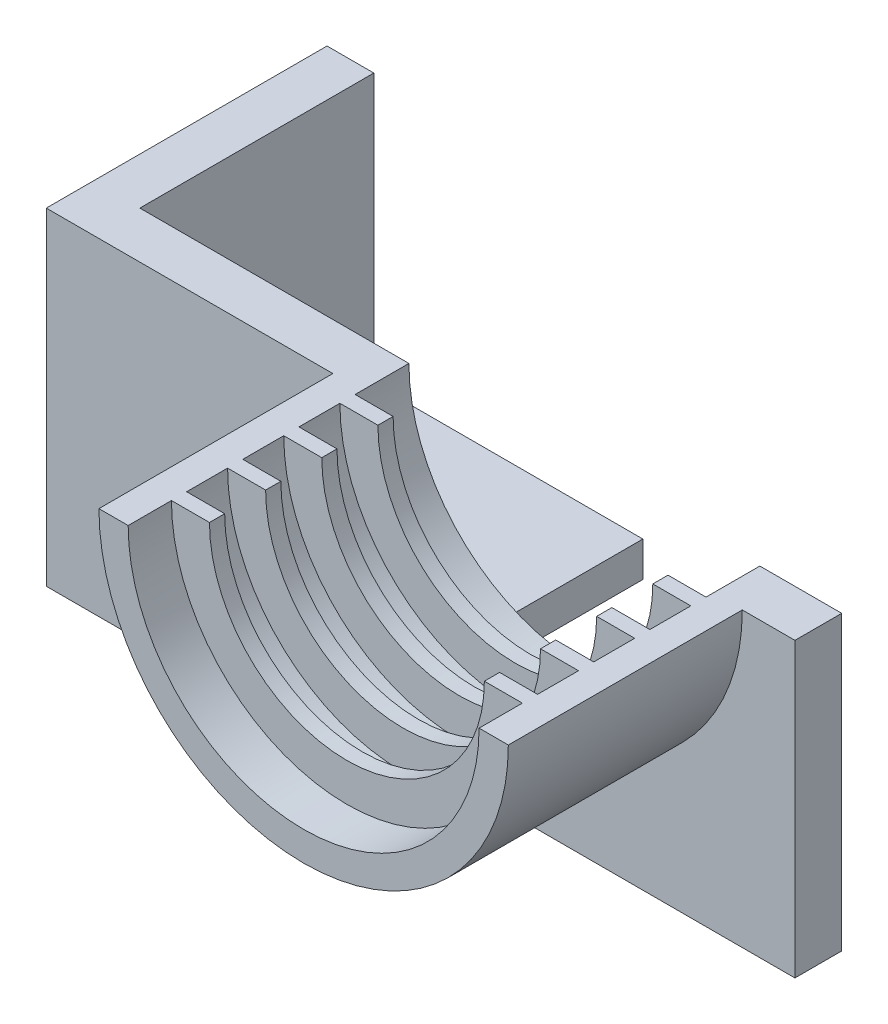
ISO-10303-21;
HEADER;
FILE_DESCRIPTION(('STEP AP214'),'2;1');
FILE_NAME('part.step','',(''),(''),'','','');
FILE_SCHEMA(('AUTOMOTIVE_DESIGN { 1 0 10303 214 1 1 1 1 }'));
ENDSEC;
DATA;
#1=APPLICATION_CONTEXT('core data for automotive mechanical design processes');
#2=APPLICATION_PROTOCOL_DEFINITION('international standard','automotive_design',2000,#1);
#3=PRODUCT_CONTEXT('',#1,'mechanical');
#4=PRODUCT('Part','Part','',(#3));
#5=PRODUCT_RELATED_PRODUCT_CATEGORY('part','',(#4));
#6=PRODUCT_DEFINITION_FORMATION('','',#4);
#7=PRODUCT_DEFINITION_CONTEXT('part definition',#1,'design');
#8=PRODUCT_DEFINITION('design','',#6,#7);
#9=PRODUCT_DEFINITION_SHAPE('','',#8);
#10=(LENGTH_UNIT() NAMED_UNIT(*) SI_UNIT(.MILLI.,.METRE.));
#11=(NAMED_UNIT(*) PLANE_ANGLE_UNIT() SI_UNIT($,.RADIAN.));
#12=(NAMED_UNIT(*) SI_UNIT($,.STERADIAN.) SOLID_ANGLE_UNIT());
#13=UNCERTAINTY_MEASURE_WITH_UNIT(LENGTH_MEASURE(1.E-05),#10,'distance_accuracy_value','');
#14=(GEOMETRIC_REPRESENTATION_CONTEXT(3) GLOBAL_UNCERTAINTY_ASSIGNED_CONTEXT((#13)) GLOBAL_UNIT_ASSIGNED_CONTEXT((#10,
#11,#12)) REPRESENTATION_CONTEXT('',''));
#15=CARTESIAN_POINT('',(0.,0.,0.));
#16=DIRECTION('',(0.,0.,1.));
#17=DIRECTION('',(1.,0.,0.));
#18=AXIS2_PLACEMENT_3D('',#15,#16,#17);
#19=CARTESIAN_POINT('',(66.,8.,-6.));
#20=DIRECTION('',(0.,1.,0.));
#21=DIRECTION('',(-1.,0.,0.));
#22=AXIS2_PLACEMENT_3D('',#19,#20,#21);
#23=PLANE('',#22);
#24=DIRECTION('',(1.,0.,0.));
#25=VECTOR('',#24,1.);
#26=CARTESIAN_POINT('',(0.,7.99999999999999,0.));
#27=LINE('',#26,#25);
#28=CARTESIAN_POINT('',(16.,7.99999999999999,0.));
#29=VERTEX_POINT('',#28);
#30=CARTESIAN_POINT('',(55.,8.,0.));
#31=VERTEX_POINT('',#30);
#32=EDGE_CURVE('E244',#29,#31,#27,.T.);
#33=ORIENTED_EDGE('',*,*,#32,.T.);
#34=DIRECTION('',(0.,0.,1.));
#35=VECTOR('',#34,1.);
#36=CARTESIAN_POINT('',(55.,8.,-22.));
#37=LINE('',#36,#35);
#38=CARTESIAN_POINT('',(55.,8.,4.));
#39=VERTEX_POINT('',#38);
#40=EDGE_CURVE('E46',#31,#39,#37,.T.);
#41=ORIENTED_EDGE('',*,*,#40,.T.);
#42=DIRECTION('',(-1.,0.,0.));
#43=VECTOR('',#42,1.);
#44=CARTESIAN_POINT('',(66.,8.,4.));
#45=LINE('',#44,#43);
#46=CARTESIAN_POINT('',(16.,7.99999999999999,4.));
#47=VERTEX_POINT('',#46);
#48=EDGE_CURVE('E237',#39,#47,#45,.T.);
#49=ORIENTED_EDGE('',*,*,#48,.T.);
#50=DIRECTION('',(0.,0.,1.));
#51=VECTOR('',#50,1.);
#52=CARTESIAN_POINT('',(16.,7.99999999999999,-22.));
#53=LINE('',#52,#51);
#54=EDGE_CURVE('E40',#29,#47,#53,.T.);
#55=ORIENTED_EDGE('',*,*,#54,.F.);
#56=EDGE_LOOP('',(#33,#41,#49,#55));
#57=FACE_BOUND('',#56,.T.);
#58=ADVANCED_FACE('F32',(#57),#23,.F.);
#59=CARTESIAN_POINT('',(0.,33.,4.));
#60=DIRECTION('',(0.,-1.,0.));
#61=DIRECTION('',(0.,0.,-1.));
#62=AXIS2_PLACEMENT_3D('',#59,#60,#61);
#63=PLANE('',#62);
#64=DIRECTION('',(-1.,0.,0.));
#65=VECTOR('',#64,1.);
#66=CARTESIAN_POINT('',(0.,33.,4.));
#67=LINE('',#66,#65);
#68=CARTESIAN_POINT('',(55.,33.,4.));
#69=VERTEX_POINT('',#68);
#70=CARTESIAN_POINT('',(50.5,33.,4.));
#71=VERTEX_POINT('',#70);
#72=EDGE_CURVE('E234',#69,#71,#67,.T.);
#73=ORIENTED_EDGE('',*,*,#72,.F.);
#74=DIRECTION('',(0.,0.,1.));
#75=VECTOR('',#74,1.);
#76=CARTESIAN_POINT('',(55.,33.,-22.));
#77=LINE('',#76,#75);
#78=CARTESIAN_POINT('',(55.,33.,0.));
#79=VERTEX_POINT('',#78);
#80=EDGE_CURVE('E223',#79,#69,#77,.T.);
#81=ORIENTED_EDGE('',*,*,#80,.F.);
#82=DIRECTION('',(-1.,0.,0.));
#83=VECTOR('',#82,1.);
#84=CARTESIAN_POINT('',(0.,33.,0.));
#85=LINE('',#84,#83);
#86=CARTESIAN_POINT('',(48.,33.,0.));
#87=VERTEX_POINT('',#86);
#88=EDGE_CURVE('E249',#79,#87,#85,.T.);
#89=ORIENTED_EDGE('',*,*,#88,.T.);
#90=DIRECTION('',(0.,0.,1.));
#91=VECTOR('',#90,1.);
#92=CARTESIAN_POINT('',(48.,33.,0.));
#93=LINE('',#92,#91);
#94=CARTESIAN_POINT('',(48.,33.,4.6));
#95=VERTEX_POINT('',#94);
#96=EDGE_CURVE('E252',#87,#95,#93,.T.);
#97=ORIENTED_EDGE('',*,*,#96,.T.);
#98=DIRECTION('',(-1.,0.,0.));
#99=VECTOR('',#98,1.);
#100=CARTESIAN_POINT('',(44.75,33.,4.6));
#101=LINE('',#100,#99);
#102=CARTESIAN_POINT('',(44.75,33.,4.6));
#103=VERTEX_POINT('',#102);
#104=EDGE_CURVE('E384',#95,#103,#101,.T.);
#105=ORIENTED_EDGE('',*,*,#104,.T.);
#106=DIRECTION('',(0.,0.,-1.));
#107=VECTOR('',#106,1.);
#108=CARTESIAN_POINT('',(44.75,33.,5.9));
#109=LINE('',#108,#107);
#110=CARTESIAN_POINT('',(44.75,33.,5.9));
#111=VERTEX_POINT('',#110);
#112=EDGE_CURVE('E392',#111,#103,#109,.T.);
#113=ORIENTED_EDGE('',*,*,#112,.F.);
#114=DIRECTION('',(-1.,0.,0.));
#115=VECTOR('',#114,1.);
#116=CARTESIAN_POINT('',(44.75,33.,5.9));
#117=LINE('',#116,#115);
#118=CARTESIAN_POINT('',(48.,33.,5.9));
#119=VERTEX_POINT('',#118);
#120=EDGE_CURVE('E374',#119,#111,#117,.T.);
#121=ORIENTED_EDGE('',*,*,#120,.F.);
#122=CARTESIAN_POINT('',(48.,33.,9.4));
#123=VERTEX_POINT('',#122);
#124=EDGE_CURVE('E427',#119,#123,#93,.T.);
#125=ORIENTED_EDGE('',*,*,#124,.T.);
#126=DIRECTION('',(-1.,0.,0.));
#127=VECTOR('',#126,1.);
#128=CARTESIAN_POINT('',(44.75,33.,9.4));
#129=LINE('',#128,#127);
#130=CARTESIAN_POINT('',(44.75,33.,9.4));
#131=VERTEX_POINT('',#130);
#132=EDGE_CURVE('E359',#123,#131,#129,.T.);
#133=ORIENTED_EDGE('',*,*,#132,.T.);
#134=DIRECTION('',(0.,0.,-1.));
#135=VECTOR('',#134,1.);
#136=CARTESIAN_POINT('',(44.75,33.,10.7));
#137=LINE('',#136,#135);
#138=CARTESIAN_POINT('',(44.75,33.,10.7));
#139=VERTEX_POINT('',#138);
#140=EDGE_CURVE('E367',#139,#131,#137,.T.);
#141=ORIENTED_EDGE('',*,*,#140,.F.);
#142=DIRECTION('',(-1.,0.,0.));
#143=VECTOR('',#142,1.);
#144=CARTESIAN_POINT('',(44.75,33.,10.7));
#145=LINE('',#144,#143);
#146=CARTESIAN_POINT('',(48.,33.,10.7));
#147=VERTEX_POINT('',#146);
#148=EDGE_CURVE('E349',#147,#139,#145,.T.);
#149=ORIENTED_EDGE('',*,*,#148,.F.);
#150=CARTESIAN_POINT('',(48.,33.,14.2));
#151=VERTEX_POINT('',#150);
#152=EDGE_CURVE('E431',#147,#151,#93,.T.);
#153=ORIENTED_EDGE('',*,*,#152,.T.);
#154=DIRECTION('',(-1.,0.,0.));
#155=VECTOR('',#154,1.);
#156=CARTESIAN_POINT('',(44.75,33.,14.2));
#157=LINE('',#156,#155);
#158=CARTESIAN_POINT('',(44.75,33.,14.2));
#159=VERTEX_POINT('',#158);
#160=EDGE_CURVE('E334',#151,#159,#157,.T.);
#161=ORIENTED_EDGE('',*,*,#160,.T.);
#162=DIRECTION('',(0.,0.,-1.));
#163=VECTOR('',#162,1.);
#164=CARTESIAN_POINT('',(44.75,33.,15.5));
#165=LINE('',#164,#163);
#166=CARTESIAN_POINT('',(44.75,33.,15.5));
#167=VERTEX_POINT('',#166);
#168=EDGE_CURVE('E342',#167,#159,#165,.T.);
#169=ORIENTED_EDGE('',*,*,#168,.F.);
#170=DIRECTION('',(-1.,0.,0.));
#171=VECTOR('',#170,1.);
#172=CARTESIAN_POINT('',(44.75,33.,15.5));
#173=LINE('',#172,#171);
#174=CARTESIAN_POINT('',(48.,33.,15.5));
#175=VERTEX_POINT('',#174);
#176=EDGE_CURVE('E324',#175,#167,#173,.T.);
#177=ORIENTED_EDGE('',*,*,#176,.F.);
#178=CARTESIAN_POINT('',(48.,33.,19.));
#179=VERTEX_POINT('',#178);
#180=EDGE_CURVE('E432',#175,#179,#93,.T.);
#181=ORIENTED_EDGE('',*,*,#180,.T.);
#182=DIRECTION('',(-1.,0.,0.));
#183=VECTOR('',#182,1.);
#184=CARTESIAN_POINT('',(44.75,33.,19.));
#185=LINE('',#184,#183);
#186=CARTESIAN_POINT('',(44.75,33.,19.));
#187=VERTEX_POINT('',#186);
#188=EDGE_CURVE('E309',#179,#187,#185,.T.);
#189=ORIENTED_EDGE('',*,*,#188,.T.);
#190=DIRECTION('',(0.,0.,-1.));
#191=VECTOR('',#190,1.);
#192=CARTESIAN_POINT('',(44.75,33.,20.3));
#193=LINE('',#192,#191);
#194=CARTESIAN_POINT('',(44.75,33.,20.3));
#195=VERTEX_POINT('',#194);
#196=EDGE_CURVE('E317',#195,#187,#193,.T.);
#197=ORIENTED_EDGE('',*,*,#196,.F.);
#198=DIRECTION('',(-1.,0.,0.));
#199=VECTOR('',#198,1.);
#200=CARTESIAN_POINT('',(44.75,33.,20.3));
#201=LINE('',#200,#199);
#202=CARTESIAN_POINT('',(48.,33.,20.3));
#203=VERTEX_POINT('',#202);
#204=EDGE_CURVE('E299',#203,#195,#201,.T.);
#205=ORIENTED_EDGE('',*,*,#204,.F.);
#206=CARTESIAN_POINT('',(48.,33.,24.));
#207=VERTEX_POINT('',#206);
#208=EDGE_CURVE('E413',#203,#207,#93,.T.);
#209=ORIENTED_EDGE('',*,*,#208,.T.);
#210=DIRECTION('',(-1.,0.,0.));
#211=VECTOR('',#210,1.);
#212=CARTESIAN_POINT('',(48.,33.,24.));
#213=LINE('',#212,#211);
#214=CARTESIAN_POINT('',(50.5,33.,24.));
#215=VERTEX_POINT('',#214);
#216=EDGE_CURVE('E403',#215,#207,#213,.T.);
#217=ORIENTED_EDGE('',*,*,#216,.F.);
#218=DIRECTION('',(0.,0.,-1.));
#219=VECTOR('',#218,1.);
#220=CARTESIAN_POINT('',(50.5,33.,24.));
#221=LINE('',#220,#219);
#222=EDGE_CURVE('E243',#215,#71,#221,.T.);
#223=ORIENTED_EDGE('',*,*,#222,.T.);
#224=EDGE_LOOP('',(#73,#81,#89,#97,#105,#113,#121,#125,#133,#141,#149,#153,#161,#169,#177,#181,
#189,#197,#205,#209,#217,#223));
#225=FACE_BOUND('',#224,.T.);
#226=ADVANCED_FACE('F240',(#225),#63,.F.);
#227=CARTESIAN_POINT('',(0.,0.,4.));
#228=DIRECTION('',(0.,0.,-1.));
#229=DIRECTION('',(-1.,0.,0.));
#230=AXIS2_PLACEMENT_3D('',#227,#228,#229);
#231=PLANE('',#230);
#232=ORIENTED_EDGE('',*,*,#48,.F.);
#233=DIRECTION('',(0.,-1.,0.));
#234=VECTOR('',#233,1.);
#235=CARTESIAN_POINT('',(55.,8.,4.));
#236=LINE('',#235,#234);
#237=EDGE_CURVE('E226',#69,#39,#236,.T.);
#238=ORIENTED_EDGE('',*,*,#237,.F.);
#239=ORIENTED_EDGE('',*,*,#72,.T.);
#240=CARTESIAN_POINT('',(33.,33.,4.));
#241=DIRECTION('',(0.,0.,1.));
#242=DIRECTION('',(1.,0.,0.));
#243=AXIS2_PLACEMENT_3D('',#240,#241,#242);
#244=CIRCLE('',#243,17.5);
#245=CARTESIAN_POINT('',(15.5,33.,4.));
#246=VERTEX_POINT('',#245);
#247=EDGE_CURVE('E395',#246,#71,#244,.T.);
#248=ORIENTED_EDGE('',*,*,#247,.F.);
#249=CARTESIAN_POINT('',(-9.,33.,4.));
#250=VERTEX_POINT('',#249);
#251=EDGE_CURVE('E245',#246,#250,#67,.T.);
#252=ORIENTED_EDGE('',*,*,#251,.T.);
#253=DIRECTION('',(0.,1.,0.));
#254=VECTOR('',#253,1.);
#255=CARTESIAN_POINT('',(-9.,8.,4.));
#256=LINE('',#255,#254);
#257=CARTESIAN_POINT('',(-9.00000000000001,4.99999999999999,4.));
#258=VERTEX_POINT('',#257);
#259=EDGE_CURVE('E289',#258,#250,#256,.T.);
#260=ORIENTED_EDGE('',*,*,#259,.F.);
#261=DIRECTION('',(-1.,0.,0.));
#262=VECTOR('',#261,1.);
#263=CARTESIAN_POINT('',(-9.00000000000001,4.99999999999999,4.));
#264=LINE('',#263,#262);
#265=CARTESIAN_POINT('',(16.,4.99999999999999,4.));
#266=VERTEX_POINT('',#265);
#267=EDGE_CURVE('E493',#266,#258,#264,.T.);
#268=ORIENTED_EDGE('',*,*,#267,.F.);
#269=DIRECTION('',(0.,1.,0.));
#270=VECTOR('',#269,1.);
#271=CARTESIAN_POINT('',(16.,4.99999999999999,4.));
#272=LINE('',#271,#270);
#273=EDGE_CURVE('E499',#266,#47,#272,.T.);
#274=ORIENTED_EDGE('',*,*,#273,.T.);
#275=EDGE_LOOP('',(#232,#238,#239,#248,#252,#260,#268,#274));
#276=FACE_BOUND('',#275,.T.);
#277=ADVANCED_FACE('F233',(#276),#231,.F.);
#278=CARTESIAN_POINT('',(0.,0.,0.));
#279=DIRECTION('',(0.,0.,-1.));
#280=DIRECTION('',(-1.,0.,0.));
#281=AXIS2_PLACEMENT_3D('',#278,#279,#280);
#282=PLANE('',#281);
#283=DIRECTION('',(0.,1.,0.));
#284=VECTOR('',#283,1.);
#285=CARTESIAN_POINT('',(55.,0.,0.));
#286=LINE('',#285,#284);
#287=EDGE_CURVE('E11',#31,#79,#286,.T.);
#288=ORIENTED_EDGE('',*,*,#287,.F.);
#289=ORIENTED_EDGE('',*,*,#32,.F.);
#290=CARTESIAN_POINT('',(-5.00000000000003,7.99999999999999,0.));
#291=VERTEX_POINT('',#290);
#292=EDGE_CURVE('E247',#291,#29,#27,.T.);
#293=ORIENTED_EDGE('',*,*,#292,.F.);
#294=DIRECTION('',(0.,-1.,0.));
#295=VECTOR('',#294,1.);
#296=CARTESIAN_POINT('',(-5.00000000000003,33.,0.));
#297=LINE('',#296,#295);
#298=CARTESIAN_POINT('',(-5.00000000000003,33.,0.));
#299=VERTEX_POINT('',#298);
#300=EDGE_CURVE('E258',#299,#291,#297,.T.);
#301=ORIENTED_EDGE('',*,*,#300,.F.);
#302=CARTESIAN_POINT('',(18.,33.,0.));
#303=VERTEX_POINT('',#302);
#304=EDGE_CURVE('E254',#303,#299,#85,.T.);
#305=ORIENTED_EDGE('',*,*,#304,.F.);
#306=CARTESIAN_POINT('',(33.,33.,0.));
#307=DIRECTION('',(0.,0.,1.));
#308=DIRECTION('',(1.,0.,0.));
#309=AXIS2_PLACEMENT_3D('',#306,#307,#308);
#310=CIRCLE('',#309,15.);
#311=EDGE_CURVE('E411',#303,#87,#310,.T.);
#312=ORIENTED_EDGE('',*,*,#311,.T.);
#313=ORIENTED_EDGE('',*,*,#88,.F.);
#314=EDGE_LOOP('',(#288,#289,#293,#301,#305,#312,#313));
#315=FACE_BOUND('',#314,.T.);
#316=ADVANCED_FACE('F526',(#315),#282,.T.);
#317=CARTESIAN_POINT('',(33.,33.,0.));
#318=DIRECTION('',(0.,0.,1.));
#319=DIRECTION('',(1.,0.,0.));
#320=AXIS2_PLACEMENT_3D('',#317,#318,#319);
#321=CYLINDRICAL_SURFACE('',#320,15.);
#322=CARTESIAN_POINT('',(33.,33.,19.));
#323=DIRECTION('',(0.,0.,1.));
#324=DIRECTION('',(1.,0.,0.));
#325=AXIS2_PLACEMENT_3D('',#322,#323,#324);
#326=CIRCLE('',#325,15.);
#327=CARTESIAN_POINT('',(18.,33.,19.));
#328=VERTEX_POINT('',#327);
#329=EDGE_CURVE('E295',#328,#179,#326,.T.);
#330=ORIENTED_EDGE('',*,*,#329,.T.);
#331=ORIENTED_EDGE('',*,*,#180,.F.);
#332=CARTESIAN_POINT('',(33.,33.,15.5));
#333=DIRECTION('',(0.,0.,1.));
#334=DIRECTION('',(1.,0.,0.));
#335=AXIS2_PLACEMENT_3D('',#332,#333,#334);
#336=CIRCLE('',#335,15.);
#337=CARTESIAN_POINT('',(18.,33.,15.5));
#338=VERTEX_POINT('',#337);
#339=EDGE_CURVE('E321',#338,#175,#336,.T.);
#340=ORIENTED_EDGE('',*,*,#339,.F.);
#341=DIRECTION('',(0.,0.,1.));
#342=VECTOR('',#341,1.);
#343=CARTESIAN_POINT('',(18.,33.,0.));
#344=LINE('',#343,#342);
#345=EDGE_CURVE('E421',#338,#328,#344,.T.);
#346=ORIENTED_EDGE('',*,*,#345,.T.);
#347=EDGE_LOOP('',(#330,#331,#340,#346));
#348=FACE_BOUND('',#347,.T.);
#349=ADVANCED_FACE('F460',(#348),#321,.F.);
#350=CARTESIAN_POINT('',(33.,33.,14.2));
#351=DIRECTION('',(0.,0.,1.));
#352=DIRECTION('',(1.,0.,0.));
#353=AXIS2_PLACEMENT_3D('',#350,#351,#352);
#354=CIRCLE('',#353,15.);
#355=CARTESIAN_POINT('',(18.,33.,14.2));
#356=VERTEX_POINT('',#355);
#357=EDGE_CURVE('E320',#356,#151,#354,.T.);
#358=ORIENTED_EDGE('',*,*,#357,.T.);
#359=ORIENTED_EDGE('',*,*,#152,.F.);
#360=CARTESIAN_POINT('',(33.,33.,10.7));
#361=DIRECTION('',(0.,0.,1.));
#362=DIRECTION('',(1.,0.,0.));
#363=AXIS2_PLACEMENT_3D('',#360,#361,#362);
#364=CIRCLE('',#363,15.);
#365=CARTESIAN_POINT('',(18.,33.,10.7));
#366=VERTEX_POINT('',#365);
#367=EDGE_CURVE('E346',#366,#147,#364,.T.);
#368=ORIENTED_EDGE('',*,*,#367,.F.);
#369=EDGE_CURVE('E420',#366,#356,#344,.T.);
#370=ORIENTED_EDGE('',*,*,#369,.T.);
#371=EDGE_LOOP('',(#358,#359,#368,#370));
#372=FACE_BOUND('',#371,.T.);
#373=ADVANCED_FACE('F561',(#372),#321,.F.);
#374=CARTESIAN_POINT('',(33.,33.,9.4));
#375=DIRECTION('',(0.,0.,1.));
#376=DIRECTION('',(1.,0.,0.));
#377=AXIS2_PLACEMENT_3D('',#374,#375,#376);
#378=CIRCLE('',#377,15.);
#379=CARTESIAN_POINT('',(18.,33.,9.4));
#380=VERTEX_POINT('',#379);
#381=EDGE_CURVE('E345',#380,#123,#378,.T.);
#382=ORIENTED_EDGE('',*,*,#381,.T.);
#383=ORIENTED_EDGE('',*,*,#124,.F.);
#384=CARTESIAN_POINT('',(33.,33.,5.9));
#385=DIRECTION('',(0.,0.,1.));
#386=DIRECTION('',(1.,0.,0.));
#387=AXIS2_PLACEMENT_3D('',#384,#385,#386);
#388=CIRCLE('',#387,15.);
#389=CARTESIAN_POINT('',(18.,33.,5.9));
#390=VERTEX_POINT('',#389);
#391=EDGE_CURVE('E371',#390,#119,#388,.T.);
#392=ORIENTED_EDGE('',*,*,#391,.F.);
#393=EDGE_CURVE('E415',#390,#380,#344,.T.);
#394=ORIENTED_EDGE('',*,*,#393,.T.);
#395=EDGE_LOOP('',(#382,#383,#392,#394));
#396=FACE_BOUND('',#395,.T.);
#397=ADVANCED_FACE('F563',(#396),#321,.F.);
#398=CARTESIAN_POINT('',(33.,33.,4.6));
#399=DIRECTION('',(0.,0.,1.));
#400=DIRECTION('',(1.,0.,0.));
#401=AXIS2_PLACEMENT_3D('',#398,#399,#400);
#402=CIRCLE('',#401,15.);
#403=CARTESIAN_POINT('',(18.,33.,4.6));
#404=VERTEX_POINT('',#403);
#405=EDGE_CURVE('E370',#404,#95,#402,.T.);
#406=ORIENTED_EDGE('',*,*,#405,.T.);
#407=ORIENTED_EDGE('',*,*,#96,.F.);
#408=ORIENTED_EDGE('',*,*,#311,.F.);
#409=EDGE_CURVE('E414',#303,#404,#344,.T.);
#410=ORIENTED_EDGE('',*,*,#409,.T.);
#411=EDGE_LOOP('',(#406,#407,#408,#410));
#412=FACE_BOUND('',#411,.T.);
#413=ADVANCED_FACE('F531',(#412),#321,.F.);
#414=ORIENTED_EDGE('',*,*,#251,.F.);
#415=DIRECTION('',(0.,0.,-1.));
#416=VECTOR('',#415,1.);
#417=CARTESIAN_POINT('',(15.5,33.,24.));
#418=LINE('',#417,#416);
#419=CARTESIAN_POINT('',(15.5,33.,24.));
#420=VERTEX_POINT('',#419);
#421=EDGE_CURVE('E408',#420,#246,#418,.T.);
#422=ORIENTED_EDGE('',*,*,#421,.F.);
#423=DIRECTION('',(-1.,0.,0.));
#424=VECTOR('',#423,1.);
#425=CARTESIAN_POINT('',(18.,33.,24.));
#426=LINE('',#425,#424);
#427=CARTESIAN_POINT('',(18.,33.,24.));
#428=VERTEX_POINT('',#427);
#429=EDGE_CURVE('E399',#428,#420,#426,.T.);
#430=ORIENTED_EDGE('',*,*,#429,.F.);
#431=CARTESIAN_POINT('',(18.,33.,20.3));
#432=VERTEX_POINT('',#431);
#433=EDGE_CURVE('E416',#432,#428,#344,.T.);
#434=ORIENTED_EDGE('',*,*,#433,.F.);
#435=DIRECTION('',(-1.,0.,0.));
#436=VECTOR('',#435,1.);
#437=CARTESIAN_POINT('',(18.,33.,20.3));
#438=LINE('',#437,#436);
#439=CARTESIAN_POINT('',(21.25,33.,20.3));
#440=VERTEX_POINT('',#439);
#441=EDGE_CURVE('E304',#440,#432,#438,.T.);
#442=ORIENTED_EDGE('',*,*,#441,.F.);
#443=DIRECTION('',(0.,0.,-1.));
#444=VECTOR('',#443,1.);
#445=CARTESIAN_POINT('',(21.25,33.,20.3));
#446=LINE('',#445,#444);
#447=CARTESIAN_POINT('',(21.25,33.,19.));
#448=VERTEX_POINT('',#447);
#449=EDGE_CURVE('E307',#440,#448,#446,.T.);
#450=ORIENTED_EDGE('',*,*,#449,.T.);
#451=DIRECTION('',(-1.,0.,0.));
#452=VECTOR('',#451,1.);
#453=CARTESIAN_POINT('',(18.,33.,19.));
#454=LINE('',#453,#452);
#455=EDGE_CURVE('E300',#448,#328,#454,.T.);
#456=ORIENTED_EDGE('',*,*,#455,.T.);
#457=ORIENTED_EDGE('',*,*,#345,.F.);
#458=DIRECTION('',(-1.,0.,0.));
#459=VECTOR('',#458,1.);
#460=CARTESIAN_POINT('',(18.,33.,15.5));
#461=LINE('',#460,#459);
#462=CARTESIAN_POINT('',(21.25,33.,15.5));
#463=VERTEX_POINT('',#462);
#464=EDGE_CURVE('E329',#463,#338,#461,.T.);
#465=ORIENTED_EDGE('',*,*,#464,.F.);
#466=DIRECTION('',(0.,0.,-1.));
#467=VECTOR('',#466,1.);
#468=CARTESIAN_POINT('',(21.25,33.,15.5));
#469=LINE('',#468,#467);
#470=CARTESIAN_POINT('',(21.25,33.,14.2));
#471=VERTEX_POINT('',#470);
#472=EDGE_CURVE('E332',#463,#471,#469,.T.);
#473=ORIENTED_EDGE('',*,*,#472,.T.);
#474=DIRECTION('',(-1.,0.,0.));
#475=VECTOR('',#474,1.);
#476=CARTESIAN_POINT('',(18.,33.,14.2));
#477=LINE('',#476,#475);
#478=EDGE_CURVE('E325',#471,#356,#477,.T.);
#479=ORIENTED_EDGE('',*,*,#478,.T.);
#480=ORIENTED_EDGE('',*,*,#369,.F.);
#481=DIRECTION('',(-1.,0.,0.));
#482=VECTOR('',#481,1.);
#483=CARTESIAN_POINT('',(18.,33.,10.7));
#484=LINE('',#483,#482);
#485=CARTESIAN_POINT('',(21.25,33.,10.7));
#486=VERTEX_POINT('',#485);
#487=EDGE_CURVE('E354',#486,#366,#484,.T.);
#488=ORIENTED_EDGE('',*,*,#487,.F.);
#489=DIRECTION('',(0.,0.,-1.));
#490=VECTOR('',#489,1.);
#491=CARTESIAN_POINT('',(21.25,33.,10.7));
#492=LINE('',#491,#490);
#493=CARTESIAN_POINT('',(21.25,33.,9.4));
#494=VERTEX_POINT('',#493);
#495=EDGE_CURVE('E357',#486,#494,#492,.T.);
#496=ORIENTED_EDGE('',*,*,#495,.T.);
#497=DIRECTION('',(-1.,0.,0.));
#498=VECTOR('',#497,1.);
#499=CARTESIAN_POINT('',(18.,33.,9.4));
#500=LINE('',#499,#498);
#501=EDGE_CURVE('E350',#494,#380,#500,.T.);
#502=ORIENTED_EDGE('',*,*,#501,.T.);
#503=ORIENTED_EDGE('',*,*,#393,.F.);
#504=DIRECTION('',(-1.,0.,0.));
#505=VECTOR('',#504,1.);
#506=CARTESIAN_POINT('',(18.,33.,5.9));
#507=LINE('',#506,#505);
#508=CARTESIAN_POINT('',(21.25,33.,5.9));
#509=VERTEX_POINT('',#508);
#510=EDGE_CURVE('E379',#509,#390,#507,.T.);
#511=ORIENTED_EDGE('',*,*,#510,.F.);
#512=DIRECTION('',(0.,0.,-1.));
#513=VECTOR('',#512,1.);
#514=CARTESIAN_POINT('',(21.25,33.,5.9));
#515=LINE('',#514,#513);
#516=CARTESIAN_POINT('',(21.25,33.,4.6));
#517=VERTEX_POINT('',#516);
#518=EDGE_CURVE('E382',#509,#517,#515,.T.);
#519=ORIENTED_EDGE('',*,*,#518,.T.);
#520=DIRECTION('',(-1.,0.,0.));
#521=VECTOR('',#520,1.);
#522=CARTESIAN_POINT('',(18.,33.,4.6));
#523=LINE('',#522,#521);
#524=EDGE_CURVE('E375',#517,#404,#523,.T.);
#525=ORIENTED_EDGE('',*,*,#524,.T.);
#526=ORIENTED_EDGE('',*,*,#409,.F.);
#527=ORIENTED_EDGE('',*,*,#304,.T.);
#528=DIRECTION('',(0.,0.,1.));
#529=VECTOR('',#528,1.);
#530=CARTESIAN_POINT('',(-5.00000000000003,33.,-20.));
#531=LINE('',#530,#529);
#532=CARTESIAN_POINT('',(-5.00000000000003,33.,-20.));
#533=VERTEX_POINT('',#532);
#534=EDGE_CURVE('E286',#533,#299,#531,.T.);
#535=ORIENTED_EDGE('',*,*,#534,.F.);
#536=DIRECTION('',(1.,0.,0.));
#537=VECTOR('',#536,1.);
#538=CARTESIAN_POINT('',(-9.,33.,-20.));
#539=LINE('',#538,#537);
#540=CARTESIAN_POINT('',(-9.,33.,-20.));
#541=VERTEX_POINT('',#540);
#542=EDGE_CURVE('E277',#541,#533,#539,.T.);
#543=ORIENTED_EDGE('',*,*,#542,.F.);
#544=DIRECTION('',(0.,0.,-1.));
#545=VECTOR('',#544,1.);
#546=CARTESIAN_POINT('',(-9.,33.,4.));
#547=LINE('',#546,#545);
#548=EDGE_CURVE('E292',#250,#541,#547,.T.);
#549=ORIENTED_EDGE('',*,*,#548,.F.);
#550=EDGE_LOOP('',(#414,#422,#430,#434,#442,#450,#456,#457,#465,#473,#479,#480,#488,#496,#502,
#503,#511,#519,#525,#526,#527,#535,#543,#549));
#551=FACE_BOUND('',#550,.T.);
#552=ADVANCED_FACE('F34',(#551),#63,.F.);
#553=ORIENTED_EDGE('',*,*,#208,.F.);
#554=CARTESIAN_POINT('',(33.,33.,20.3));
#555=DIRECTION('',(0.,0.,1.));
#556=DIRECTION('',(1.,0.,0.));
#557=AXIS2_PLACEMENT_3D('',#554,#555,#556);
#558=CIRCLE('',#557,15.);
#559=EDGE_CURVE('E296',#432,#203,#558,.T.);
#560=ORIENTED_EDGE('',*,*,#559,.F.);
#561=ORIENTED_EDGE('',*,*,#433,.T.);
#562=CARTESIAN_POINT('',(33.,33.,24.));
#563=DIRECTION('',(0.,0.,-1.));
#564=DIRECTION('',(1.,0.,0.));
#565=AXIS2_PLACEMENT_3D('',#562,#563,#564);
#566=CIRCLE('',#565,15.);
#567=EDGE_CURVE('E396',#207,#428,#566,.T.);
#568=ORIENTED_EDGE('',*,*,#567,.F.);
#569=EDGE_LOOP('',(#553,#560,#561,#568));
#570=FACE_BOUND('',#569,.T.);
#571=ADVANCED_FACE('F474',(#570),#321,.F.);
#572=CARTESIAN_POINT('',(33.,33.,24.));
#573=DIRECTION('',(0.,0.,-1.));
#574=DIRECTION('',(-1.,0.,0.));
#575=AXIS2_PLACEMENT_3D('',#572,#573,#574);
#576=CYLINDRICAL_SURFACE('',#575,17.5);
#577=ORIENTED_EDGE('',*,*,#247,.T.);
#578=ORIENTED_EDGE('',*,*,#222,.F.);
#579=CARTESIAN_POINT('',(33.,33.,24.));
#580=DIRECTION('',(0.,0.,1.));
#581=DIRECTION('',(1.,0.,0.));
#582=AXIS2_PLACEMENT_3D('',#579,#580,#581);
#583=CIRCLE('',#582,17.5);
#584=EDGE_CURVE('E401',#420,#215,#583,.T.);
#585=ORIENTED_EDGE('',*,*,#584,.F.);
#586=ORIENTED_EDGE('',*,*,#421,.T.);
#587=EDGE_LOOP('',(#577,#578,#585,#586));
#588=FACE_BOUND('',#587,.T.);
#589=ADVANCED_FACE('F480',(#588),#576,.T.);
#590=CARTESIAN_POINT('',(33.,33.,24.));
#591=DIRECTION('',(0.,0.,1.));
#592=DIRECTION('',(1.,0.,0.));
#593=AXIS2_PLACEMENT_3D('',#590,#591,#592);
#594=PLANE('',#593);
#595=ORIENTED_EDGE('',*,*,#567,.T.);
#596=ORIENTED_EDGE('',*,*,#429,.T.);
#597=ORIENTED_EDGE('',*,*,#584,.T.);
#598=ORIENTED_EDGE('',*,*,#216,.T.);
#599=EDGE_LOOP('',(#595,#596,#597,#598));
#600=FACE_BOUND('',#599,.T.);
#601=ADVANCED_FACE('F478',(#600),#594,.T.);
#602=CARTESIAN_POINT('',(33.,33.,5.9));
#603=DIRECTION('',(0.,0.,-1.));
#604=DIRECTION('',(-1.,0.,0.));
#605=AXIS2_PLACEMENT_3D('',#602,#603,#604);
#606=CYLINDRICAL_SURFACE('',#605,11.75);
#607=CARTESIAN_POINT('',(33.,33.,4.6));
#608=DIRECTION('',(0.,0.,-1.));
#609=DIRECTION('',(1.,0.,0.));
#610=AXIS2_PLACEMENT_3D('',#607,#608,#609);
#611=CIRCLE('',#610,11.75);
#612=EDGE_CURVE('E386',#103,#517,#611,.T.);
#613=ORIENTED_EDGE('',*,*,#612,.T.);
#614=ORIENTED_EDGE('',*,*,#518,.F.);
#615=CARTESIAN_POINT('',(33.,33.,5.9));
#616=DIRECTION('',(0.,0.,-1.));
#617=DIRECTION('',(1.,0.,0.));
#618=AXIS2_PLACEMENT_3D('',#615,#616,#617);
#619=CIRCLE('',#618,11.75);
#620=EDGE_CURVE('E377',#111,#509,#619,.T.);
#621=ORIENTED_EDGE('',*,*,#620,.F.);
#622=ORIENTED_EDGE('',*,*,#112,.T.);
#623=EDGE_LOOP('',(#613,#614,#621,#622));
#624=FACE_BOUND('',#623,.T.);
#625=ADVANCED_FACE('F541',(#624),#606,.F.);
#626=CARTESIAN_POINT('',(33.,33.,5.9));
#627=DIRECTION('',(0.,0.,1.));
#628=DIRECTION('',(1.,0.,0.));
#629=AXIS2_PLACEMENT_3D('',#626,#627,#628);
#630=PLANE('',#629);
#631=ORIENTED_EDGE('',*,*,#391,.T.);
#632=ORIENTED_EDGE('',*,*,#120,.T.);
#633=ORIENTED_EDGE('',*,*,#620,.T.);
#634=ORIENTED_EDGE('',*,*,#510,.T.);
#635=EDGE_LOOP('',(#631,#632,#633,#634));
#636=FACE_BOUND('',#635,.T.);
#637=ADVANCED_FACE('F545',(#636),#630,.T.);
#638=CARTESIAN_POINT('',(33.,33.,4.6));
#639=DIRECTION('',(0.,0.,1.));
#640=DIRECTION('',(1.,0.,0.));
#641=AXIS2_PLACEMENT_3D('',#638,#639,#640);
#642=PLANE('',#641);
#643=ORIENTED_EDGE('',*,*,#405,.F.);
#644=ORIENTED_EDGE('',*,*,#524,.F.);
#645=ORIENTED_EDGE('',*,*,#612,.F.);
#646=ORIENTED_EDGE('',*,*,#104,.F.);
#647=EDGE_LOOP('',(#643,#644,#645,#646));
#648=FACE_BOUND('',#647,.T.);
#649=ADVANCED_FACE('F535',(#648),#642,.F.);
#650=CARTESIAN_POINT('',(33.,33.,10.7));
#651=DIRECTION('',(0.,0.,-1.));
#652=DIRECTION('',(-1.,0.,0.));
#653=AXIS2_PLACEMENT_3D('',#650,#651,#652);
#654=CYLINDRICAL_SURFACE('',#653,11.75);
#655=CARTESIAN_POINT('',(33.,33.,9.4));
#656=DIRECTION('',(0.,0.,-1.));
#657=DIRECTION('',(1.,0.,0.));
#658=AXIS2_PLACEMENT_3D('',#655,#656,#657);
#659=CIRCLE('',#658,11.75);
#660=EDGE_CURVE('E361',#131,#494,#659,.T.);
#661=ORIENTED_EDGE('',*,*,#660,.T.);
#662=ORIENTED_EDGE('',*,*,#495,.F.);
#663=CARTESIAN_POINT('',(33.,33.,10.7));
#664=DIRECTION('',(0.,0.,-1.));
#665=DIRECTION('',(1.,0.,0.));
#666=AXIS2_PLACEMENT_3D('',#663,#664,#665);
#667=CIRCLE('',#666,11.75);
#668=EDGE_CURVE('E352',#139,#486,#667,.T.);
#669=ORIENTED_EDGE('',*,*,#668,.F.);
#670=ORIENTED_EDGE('',*,*,#140,.T.);
#671=EDGE_LOOP('',(#661,#662,#669,#670));
#672=FACE_BOUND('',#671,.T.);
#673=ADVANCED_FACE('F555',(#672),#654,.F.);
#674=CARTESIAN_POINT('',(33.,33.,10.7));
#675=DIRECTION('',(0.,0.,1.));
#676=DIRECTION('',(1.,0.,0.));
#677=AXIS2_PLACEMENT_3D('',#674,#675,#676);
#678=PLANE('',#677);
#679=ORIENTED_EDGE('',*,*,#367,.T.);
#680=ORIENTED_EDGE('',*,*,#148,.T.);
#681=ORIENTED_EDGE('',*,*,#668,.T.);
#682=ORIENTED_EDGE('',*,*,#487,.T.);
#683=EDGE_LOOP('',(#679,#680,#681,#682));
#684=FACE_BOUND('',#683,.T.);
#685=ADVANCED_FACE('F560',(#684),#678,.T.);
#686=CARTESIAN_POINT('',(33.,33.,9.4));
#687=DIRECTION('',(0.,0.,1.));
#688=DIRECTION('',(1.,0.,0.));
#689=AXIS2_PLACEMENT_3D('',#686,#687,#688);
#690=PLANE('',#689);
#691=ORIENTED_EDGE('',*,*,#381,.F.);
#692=ORIENTED_EDGE('',*,*,#501,.F.);
#693=ORIENTED_EDGE('',*,*,#660,.F.);
#694=ORIENTED_EDGE('',*,*,#132,.F.);
#695=EDGE_LOOP('',(#691,#692,#693,#694));
#696=FACE_BOUND('',#695,.T.);
#697=ADVANCED_FACE('F551',(#696),#690,.F.);
#698=CARTESIAN_POINT('',(33.,33.,15.5));
#699=DIRECTION('',(0.,0.,-1.));
#700=DIRECTION('',(-1.,0.,0.));
#701=AXIS2_PLACEMENT_3D('',#698,#699,#700);
#702=CYLINDRICAL_SURFACE('',#701,11.75);
#703=CARTESIAN_POINT('',(33.,33.,14.2));
#704=DIRECTION('',(0.,0.,-1.));
#705=DIRECTION('',(1.,0.,0.));
#706=AXIS2_PLACEMENT_3D('',#703,#704,#705);
#707=CIRCLE('',#706,11.75);
#708=EDGE_CURVE('E336',#159,#471,#707,.T.);
#709=ORIENTED_EDGE('',*,*,#708,.T.);
#710=ORIENTED_EDGE('',*,*,#472,.F.);
#711=CARTESIAN_POINT('',(33.,33.,15.5));
#712=DIRECTION('',(0.,0.,-1.));
#713=DIRECTION('',(1.,0.,0.));
#714=AXIS2_PLACEMENT_3D('',#711,#712,#713);
#715=CIRCLE('',#714,11.75);
#716=EDGE_CURVE('E327',#167,#463,#715,.T.);
#717=ORIENTED_EDGE('',*,*,#716,.F.);
#718=ORIENTED_EDGE('',*,*,#168,.T.);
#719=EDGE_LOOP('',(#709,#710,#717,#718));
#720=FACE_BOUND('',#719,.T.);
#721=ADVANCED_FACE('F450',(#720),#702,.F.);
#722=CARTESIAN_POINT('',(33.,33.,15.5));
#723=DIRECTION('',(0.,0.,1.));
#724=DIRECTION('',(1.,0.,0.));
#725=AXIS2_PLACEMENT_3D('',#722,#723,#724);
#726=PLANE('',#725);
#727=ORIENTED_EDGE('',*,*,#339,.T.);
#728=ORIENTED_EDGE('',*,*,#176,.T.);
#729=ORIENTED_EDGE('',*,*,#716,.T.);
#730=ORIENTED_EDGE('',*,*,#464,.T.);
#731=EDGE_LOOP('',(#727,#728,#729,#730));
#732=FACE_BOUND('',#731,.T.);
#733=ADVANCED_FACE('F458',(#732),#726,.T.);
#734=CARTESIAN_POINT('',(33.,33.,14.2));
#735=DIRECTION('',(0.,0.,1.));
#736=DIRECTION('',(1.,0.,0.));
#737=AXIS2_PLACEMENT_3D('',#734,#735,#736);
#738=PLANE('',#737);
#739=ORIENTED_EDGE('',*,*,#357,.F.);
#740=ORIENTED_EDGE('',*,*,#478,.F.);
#741=ORIENTED_EDGE('',*,*,#708,.F.);
#742=ORIENTED_EDGE('',*,*,#160,.F.);
#743=EDGE_LOOP('',(#739,#740,#741,#742));
#744=FACE_BOUND('',#743,.T.);
#745=ADVANCED_FACE('F446',(#744),#738,.F.);
#746=CARTESIAN_POINT('',(33.,33.,20.3));
#747=DIRECTION('',(0.,0.,-1.));
#748=DIRECTION('',(-1.,0.,0.));
#749=AXIS2_PLACEMENT_3D('',#746,#747,#748);
#750=CYLINDRICAL_SURFACE('',#749,11.75);
#751=CARTESIAN_POINT('',(33.,33.,19.));
#752=DIRECTION('',(0.,0.,-1.));
#753=DIRECTION('',(1.,0.,0.));
#754=AXIS2_PLACEMENT_3D('',#751,#752,#753);
#755=CIRCLE('',#754,11.75);
#756=EDGE_CURVE('E311',#187,#448,#755,.T.);
#757=ORIENTED_EDGE('',*,*,#756,.T.);
#758=ORIENTED_EDGE('',*,*,#449,.F.);
#759=CARTESIAN_POINT('',(33.,33.,20.3));
#760=DIRECTION('',(0.,0.,-1.));
#761=DIRECTION('',(1.,0.,0.));
#762=AXIS2_PLACEMENT_3D('',#759,#760,#761);
#763=CIRCLE('',#762,11.75);
#764=EDGE_CURVE('E302',#195,#440,#763,.T.);
#765=ORIENTED_EDGE('',*,*,#764,.F.);
#766=ORIENTED_EDGE('',*,*,#196,.T.);
#767=EDGE_LOOP('',(#757,#758,#765,#766));
#768=FACE_BOUND('',#767,.T.);
#769=ADVANCED_FACE('F469',(#768),#750,.F.);
#770=CARTESIAN_POINT('',(33.,33.,20.3));
#771=DIRECTION('',(0.,0.,1.));
#772=DIRECTION('',(1.,0.,0.));
#773=AXIS2_PLACEMENT_3D('',#770,#771,#772);
#774=PLANE('',#773);
#775=ORIENTED_EDGE('',*,*,#559,.T.);
#776=ORIENTED_EDGE('',*,*,#204,.T.);
#777=ORIENTED_EDGE('',*,*,#764,.T.);
#778=ORIENTED_EDGE('',*,*,#441,.T.);
#779=EDGE_LOOP('',(#775,#776,#777,#778));
#780=FACE_BOUND('',#779,.T.);
#781=ADVANCED_FACE('F473',(#780),#774,.T.);
#782=CARTESIAN_POINT('',(33.,33.,19.));
#783=DIRECTION('',(0.,0.,1.));
#784=DIRECTION('',(1.,0.,0.));
#785=AXIS2_PLACEMENT_3D('',#782,#783,#784);
#786=PLANE('',#785);
#787=ORIENTED_EDGE('',*,*,#329,.F.);
#788=ORIENTED_EDGE('',*,*,#455,.F.);
#789=ORIENTED_EDGE('',*,*,#756,.F.);
#790=ORIENTED_EDGE('',*,*,#188,.F.);
#791=EDGE_LOOP('',(#787,#788,#789,#790));
#792=FACE_BOUND('',#791,.T.);
#793=ADVANCED_FACE('F464',(#792),#786,.F.);
#794=CARTESIAN_POINT('',(-9.,0.,0.));
#795=DIRECTION('',(-1.,0.,0.));
#796=DIRECTION('',(0.,0.,1.));
#797=AXIS2_PLACEMENT_3D('',#794,#795,#796);
#798=PLANE('',#797);
#799=CARTESIAN_POINT('',(-9.,20.,-7.5));
#800=DIRECTION('',(-1.,0.,0.));
#801=DIRECTION('',(0.,0.,1.));
#802=AXIS2_PLACEMENT_3D('',#799,#800,#801);
#803=CIRCLE('',#802,1.75);
#804=CARTESIAN_POINT('',(-9.,20.,-5.75));
#805=VERTEX_POINT('',#804);
#806=EDGE_CURVE('E259',#805,#805,#803,.T.);
#807=ORIENTED_EDGE('',*,*,#806,.F.);
#808=EDGE_LOOP('',(#807));
#809=FACE_BOUND('',#808,.T.);
#810=ORIENTED_EDGE('',*,*,#259,.T.);
#811=ORIENTED_EDGE('',*,*,#548,.T.);
#812=DIRECTION('',(0.,1.,0.));
#813=VECTOR('',#812,1.);
#814=CARTESIAN_POINT('',(-9.,33.,-20.));
#815=LINE('',#814,#813);
#816=CARTESIAN_POINT('',(-9.,7.99999999999999,-20.));
#817=VERTEX_POINT('',#816);
#818=EDGE_CURVE('E263',#817,#541,#815,.T.);
#819=ORIENTED_EDGE('',*,*,#818,.F.);
#820=DIRECTION('',(0.,0.,-1.));
#821=VECTOR('',#820,1.);
#822=CARTESIAN_POINT('',(-9.00000000000001,7.99999999999999,-22.));
#823=LINE('',#822,#821);
#824=CARTESIAN_POINT('',(-9.00000000000001,7.99999999999999,-22.));
#825=VERTEX_POINT('',#824);
#826=EDGE_CURVE('E506',#817,#825,#823,.T.);
#827=ORIENTED_EDGE('',*,*,#826,.T.);
#828=DIRECTION('',(0.,1.,0.));
#829=VECTOR('',#828,1.);
#830=CARTESIAN_POINT('',(-9.00000000000001,4.99999999999999,-22.));
#831=LINE('',#830,#829);
#832=CARTESIAN_POINT('',(-9.00000000000001,4.99999999999999,-22.));
#833=VERTEX_POINT('',#832);
#834=EDGE_CURVE('E266',#833,#825,#831,.T.);
#835=ORIENTED_EDGE('',*,*,#834,.F.);
#836=DIRECTION('',(0.,0.,-1.));
#837=VECTOR('',#836,1.);
#838=CARTESIAN_POINT('',(-9.00000000000001,4.99999999999999,-22.));
#839=LINE('',#838,#837);
#840=EDGE_CURVE('E490',#258,#833,#839,.T.);
#841=ORIENTED_EDGE('',*,*,#840,.F.);
#842=EDGE_LOOP('',(#810,#811,#819,#827,#835,#841));
#843=FACE_BOUND('',#842,.T.);
#844=ADVANCED_FACE('F487',(#809,#843),#798,.T.);
#845=CARTESIAN_POINT('',(-5.00000000000003,33.,-20.));
#846=DIRECTION('',(-1.,0.,0.));
#847=DIRECTION('',(0.,-1.,0.));
#848=AXIS2_PLACEMENT_3D('',#845,#846,#847);
#849=PLANE('',#848);
#850=CARTESIAN_POINT('',(-5.00000000000003,20.,-7.5));
#851=DIRECTION('',(-1.,0.,0.));
#852=DIRECTION('',(0.,-1.,0.));
#853=AXIS2_PLACEMENT_3D('',#850,#851,#852);
#854=CIRCLE('',#853,1.75);
#855=CARTESIAN_POINT('',(-5.00000000000003,18.25,-7.5));
#856=VERTEX_POINT('',#855);
#857=EDGE_CURVE('E256',#856,#856,#854,.T.);
#858=ORIENTED_EDGE('',*,*,#857,.T.);
#859=EDGE_LOOP('',(#858));
#860=FACE_BOUND('',#859,.T.);
#861=ORIENTED_EDGE('',*,*,#300,.T.);
#862=DIRECTION('',(0.,0.,1.));
#863=VECTOR('',#862,1.);
#864=CARTESIAN_POINT('',(-5.00000000000003,7.99999999999999,-20.));
#865=LINE('',#864,#863);
#866=CARTESIAN_POINT('',(-5.00000000000003,7.99999999999999,-20.));
#867=VERTEX_POINT('',#866);
#868=EDGE_CURVE('E282',#867,#291,#865,.T.);
#869=ORIENTED_EDGE('',*,*,#868,.F.);
#870=DIRECTION('',(0.,-1.,0.));
#871=VECTOR('',#870,1.);
#872=CARTESIAN_POINT('',(-5.00000000000003,33.,-20.));
#873=LINE('',#872,#871);
#874=EDGE_CURVE('E279',#533,#867,#873,.T.);
#875=ORIENTED_EDGE('',*,*,#874,.F.);
#876=ORIENTED_EDGE('',*,*,#534,.T.);
#877=EDGE_LOOP('',(#861,#869,#875,#876));
#878=FACE_BOUND('',#877,.T.);
#879=ADVANCED_FACE('F529',(#860,#878),#849,.F.);
#880=CARTESIAN_POINT('',(0.,0.,-20.));
#881=DIRECTION('',(0.,0.,1.));
#882=DIRECTION('',(1.,0.,0.));
#883=AXIS2_PLACEMENT_3D('',#880,#881,#882);
#884=PLANE('',#883);
#885=ORIENTED_EDGE('',*,*,#818,.T.);
#886=ORIENTED_EDGE('',*,*,#542,.T.);
#887=ORIENTED_EDGE('',*,*,#874,.T.);
#888=DIRECTION('',(-1.,0.,0.));
#889=VECTOR('',#888,1.);
#890=CARTESIAN_POINT('',(-9.,7.99999999999999,-20.));
#891=LINE('',#890,#889);
#892=EDGE_CURVE('E281',#867,#817,#891,.T.);
#893=ORIENTED_EDGE('',*,*,#892,.T.);
#894=EDGE_LOOP('',(#885,#886,#887,#893));
#895=FACE_BOUND('',#894,.T.);
#896=ADVANCED_FACE('F639',(#895),#884,.F.);
#897=CARTESIAN_POINT('',(75.,20.,-7.5));
#898=DIRECTION('',(-1.,0.,0.));
#899=DIRECTION('',(0.,0.,1.));
#900=AXIS2_PLACEMENT_3D('',#897,#898,#899);
#901=CYLINDRICAL_SURFACE('',#900,1.75);
#902=ORIENTED_EDGE('',*,*,#806,.T.);
#903=EDGE_LOOP('',(#902));
#904=FACE_BOUND('',#903,.T.);
#905=ORIENTED_EDGE('',*,*,#857,.F.);
#906=EDGE_LOOP('',(#905));
#907=FACE_BOUND('',#906,.T.);
#908=ADVANCED_FACE('F634',(#904,#907),#901,.F.);
#909=CARTESIAN_POINT('',(0.,7.99999999999999,0.));
#910=DIRECTION('',(0.,1.,0.));
#911=DIRECTION('',(-1.,0.,0.));
#912=AXIS2_PLACEMENT_3D('',#909,#910,#911);
#913=PLANE('',#912);
#914=CARTESIAN_POINT('',(6.99999999999999,7.99999999999999,-7.5));
#915=DIRECTION('',(0.,1.,0.));
#916=DIRECTION('',(-1.,0.,0.));
#917=AXIS2_PLACEMENT_3D('',#914,#915,#916);
#918=CIRCLE('',#917,1.75);
#919=CARTESIAN_POINT('',(5.24999999999999,7.99999999999999,-7.5));
#920=VERTEX_POINT('',#919);
#921=EDGE_CURVE('E509',#920,#920,#918,.T.);
#922=ORIENTED_EDGE('',*,*,#921,.F.);
#923=EDGE_LOOP('',(#922));
#924=FACE_BOUND('',#923,.T.);
#925=ORIENTED_EDGE('',*,*,#892,.F.);
#926=ORIENTED_EDGE('',*,*,#868,.T.);
#927=ORIENTED_EDGE('',*,*,#292,.T.);
#928=CARTESIAN_POINT('',(16.,7.99999999999999,-22.));
#929=VERTEX_POINT('',#928);
#930=EDGE_CURVE('E511',#929,#29,#53,.T.);
#931=ORIENTED_EDGE('',*,*,#930,.F.);
#932=DIRECTION('',(1.,0.,0.));
#933=VECTOR('',#932,1.);
#934=CARTESIAN_POINT('',(-9.00000000000001,7.99999999999999,-22.));
#935=LINE('',#934,#933);
#936=EDGE_CURVE('E508',#825,#929,#935,.T.);
#937=ORIENTED_EDGE('',*,*,#936,.F.);
#938=ORIENTED_EDGE('',*,*,#826,.F.);
#939=EDGE_LOOP('',(#925,#926,#927,#931,#937,#938));
#940=FACE_BOUND('',#939,.T.);
#941=ADVANCED_FACE('F522',(#924,#940),#913,.T.);
#942=CARTESIAN_POINT('',(-9.00000000000001,4.99999999999999,-22.));
#943=DIRECTION('',(0.,0.,1.));
#944=DIRECTION('',(1.,0.,0.));
#945=AXIS2_PLACEMENT_3D('',#942,#943,#944);
#946=PLANE('',#945);
#947=ORIENTED_EDGE('',*,*,#936,.T.);
#948=DIRECTION('',(0.,1.,0.));
#949=VECTOR('',#948,1.);
#950=CARTESIAN_POINT('',(16.,4.99999999999999,-22.));
#951=LINE('',#950,#949);
#952=CARTESIAN_POINT('',(16.,4.99999999999999,-22.));
#953=VERTEX_POINT('',#952);
#954=EDGE_CURVE('E271',#953,#929,#951,.T.);
#955=ORIENTED_EDGE('',*,*,#954,.F.);
#956=DIRECTION('',(1.,0.,0.));
#957=VECTOR('',#956,1.);
#958=CARTESIAN_POINT('',(-9.00000000000001,4.99999999999999,-22.));
#959=LINE('',#958,#957);
#960=EDGE_CURVE('E502',#833,#953,#959,.T.);
#961=ORIENTED_EDGE('',*,*,#960,.F.);
#962=ORIENTED_EDGE('',*,*,#834,.T.);
#963=EDGE_LOOP('',(#947,#955,#961,#962));
#964=FACE_BOUND('',#963,.T.);
#965=ADVANCED_FACE('F672',(#964),#946,.F.);
#966=CARTESIAN_POINT('',(16.,4.99999999999999,-22.));
#967=DIRECTION('',(-1.,0.,0.));
#968=DIRECTION('',(0.,-1.,0.));
#969=AXIS2_PLACEMENT_3D('',#966,#967,#968);
#970=PLANE('',#969);
#971=ORIENTED_EDGE('',*,*,#930,.T.);
#972=ORIENTED_EDGE('',*,*,#54,.T.);
#973=ORIENTED_EDGE('',*,*,#273,.F.);
#974=DIRECTION('',(0.,0.,1.));
#975=VECTOR('',#974,1.);
#976=CARTESIAN_POINT('',(16.,4.99999999999999,-22.));
#977=LINE('',#976,#975);
#978=EDGE_CURVE('E497',#953,#266,#977,.T.);
#979=ORIENTED_EDGE('',*,*,#978,.F.);
#980=ORIENTED_EDGE('',*,*,#954,.T.);
#981=EDGE_LOOP('',(#971,#972,#973,#979,#980));
#982=FACE_BOUND('',#981,.T.);
#983=ADVANCED_FACE('F517',(#982),#970,.F.);
#984=CARTESIAN_POINT('',(0.,4.99999999999999,0.));
#985=DIRECTION('',(0.,1.,0.));
#986=DIRECTION('',(-1.,0.,0.));
#987=AXIS2_PLACEMENT_3D('',#984,#985,#986);
#988=PLANE('',#987);
#989=CARTESIAN_POINT('',(6.99999999999999,4.99999999999999,-7.5));
#990=DIRECTION('',(0.,-1.,0.));
#991=DIRECTION('',(1.,0.,0.));
#992=AXIS2_PLACEMENT_3D('',#989,#990,#991);
#993=CIRCLE('',#992,1.75);
#994=CARTESIAN_POINT('',(8.74999999999999,4.99999999999999,-7.5));
#995=VERTEX_POINT('',#994);
#996=EDGE_CURVE('E947',#995,#995,#993,.T.);
#997=ORIENTED_EDGE('',*,*,#996,.F.);
#998=EDGE_LOOP('',(#997));
#999=FACE_BOUND('',#998,.T.);
#1000=ORIENTED_EDGE('',*,*,#840,.T.);
#1001=ORIENTED_EDGE('',*,*,#960,.T.);
#1002=ORIENTED_EDGE('',*,*,#978,.T.);
#1003=ORIENTED_EDGE('',*,*,#267,.T.);
#1004=EDGE_LOOP('',(#1000,#1001,#1002,#1003));
#1005=FACE_BOUND('',#1004,.T.);
#1006=ADVANCED_FACE('F495',(#999,#1005),#988,.F.);
#1007=CARTESIAN_POINT('',(6.99999999999999,33.,-7.5));
#1008=DIRECTION('',(0.,-1.,0.));
#1009=DIRECTION('',(1.,0.,0.));
#1010=AXIS2_PLACEMENT_3D('',#1007,#1008,#1009);
#1011=CYLINDRICAL_SURFACE('',#1010,1.75);
#1012=ORIENTED_EDGE('',*,*,#921,.T.);
#1013=EDGE_LOOP('',(#1012));
#1014=FACE_BOUND('',#1013,.T.);
#1015=ORIENTED_EDGE('',*,*,#996,.T.);
#1016=EDGE_LOOP('',(#1015));
#1017=FACE_BOUND('',#1016,.T.);
#1018=ADVANCED_FACE('F700',(#1014,#1017),#1011,.F.);
#1019=CARTESIAN_POINT('',(55.,8.,-22.));
#1020=DIRECTION('',(-1.,0.,0.));
#1021=DIRECTION('',(0.,0.,1.));
#1022=AXIS2_PLACEMENT_3D('',#1019,#1020,#1021);
#1023=PLANE('',#1022);
#1024=ORIENTED_EDGE('',*,*,#287,.T.);
#1025=ORIENTED_EDGE('',*,*,#80,.T.);
#1026=ORIENTED_EDGE('',*,*,#237,.T.);
#1027=ORIENTED_EDGE('',*,*,#40,.F.);
#1028=EDGE_LOOP('',(#1024,#1025,#1026,#1027));
#1029=FACE_BOUND('',#1028,.T.);
#1030=ADVANCED_FACE('F225',(#1029),#1023,.F.);
#1031=CLOSED_SHELL('',(#58,#226,#277,#316,#349,#373,#397,#413,#552,#571,#589,#601,#625,#637,
#649,#673,#685,#697,#721,#733,#745,#769,#781,#793,#844,#879,#896,#908,#941,#965,#983,#1006,
#1018,#1030));
#1032=MANIFOLD_SOLID_BREP('B2',#1031);
#1033=ADVANCED_BREP_SHAPE_REPRESENTATION('',(#18,#1032),#14);
#1034=SHAPE_DEFINITION_REPRESENTATION(#9,#1033);
ENDSEC;
END-ISO-10303-21;
